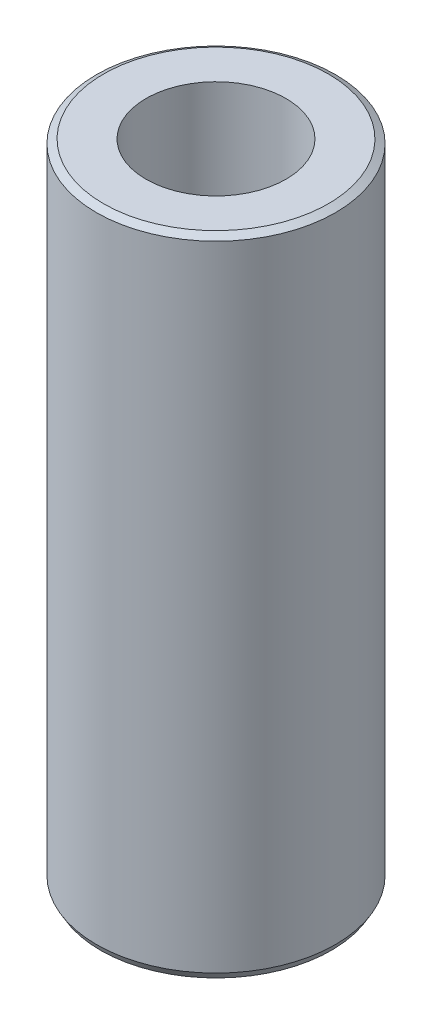
ISO-10303-21;
HEADER;
FILE_DESCRIPTION(('STEP AP214'),'2;1');
FILE_NAME('part.step','',(''),(''),'','','');
FILE_SCHEMA(('AUTOMOTIVE_DESIGN { 1 0 10303 214 1 1 1 1 }'));
ENDSEC;
DATA;
#1=APPLICATION_CONTEXT('core data for automotive mechanical design processes');
#2=APPLICATION_PROTOCOL_DEFINITION('international standard','automotive_design',2000,#1);
#3=PRODUCT_CONTEXT('',#1,'mechanical');
#4=PRODUCT('Part','Part','',(#3));
#5=PRODUCT_RELATED_PRODUCT_CATEGORY('part','',(#4));
#6=PRODUCT_DEFINITION_FORMATION('','',#4);
#7=PRODUCT_DEFINITION_CONTEXT('part definition',#1,'design');
#8=PRODUCT_DEFINITION('design','',#6,#7);
#9=PRODUCT_DEFINITION_SHAPE('','',#8);
#10=(LENGTH_UNIT() NAMED_UNIT(*) SI_UNIT(.MILLI.,.METRE.));
#11=(NAMED_UNIT(*) PLANE_ANGLE_UNIT() SI_UNIT($,.RADIAN.));
#12=(NAMED_UNIT(*) SI_UNIT($,.STERADIAN.) SOLID_ANGLE_UNIT());
#13=UNCERTAINTY_MEASURE_WITH_UNIT(LENGTH_MEASURE(1.E-05),#10,'distance_accuracy_value','');
#14=(GEOMETRIC_REPRESENTATION_CONTEXT(3) GLOBAL_UNCERTAINTY_ASSIGNED_CONTEXT((#13)) GLOBAL_UNIT_ASSIGNED_CONTEXT((#10,
#11,#12)) REPRESENTATION_CONTEXT('',''));
#15=CARTESIAN_POINT('',(0.,0.,0.));
#16=DIRECTION('',(0.,0.,1.));
#17=DIRECTION('',(1.,0.,0.));
#18=AXIS2_PLACEMENT_3D('',#15,#16,#17);
#19=CARTESIAN_POINT('',(0.,107.913975446686,0.));
#20=DIRECTION('',(0.,-1.,0.));
#21=DIRECTION('',(0.,0.,-1.));
#22=AXIS2_PLACEMENT_3D('',#19,#20,#21);
#23=CYLINDRICAL_SURFACE('',#22,20.);
#24=CARTESIAN_POINT('',(0.,107.224694065018,0.));
#25=DIRECTION('',(0.,1.,0.));
#26=DIRECTION('',(0.,0.,1.));
#27=AXIS2_PLACEMENT_3D('',#24,#25,#26);
#28=CIRCLE('',#27,20.);
#29=CARTESIAN_POINT('',(0.,107.224694065018,20.));
#30=VERTEX_POINT('',#29);
#31=EDGE_CURVE('E50',#30,#30,#28,.F.);
#32=ORIENTED_EDGE('',*,*,#31,.T.);
#33=EDGE_LOOP('',(#32));
#34=FACE_BOUND('',#33,.T.);
#35=CARTESIAN_POINT('',(0.,1.19387037376095,0.));
#36=DIRECTION('',(0.,1.,0.));
#37=DIRECTION('',(0.,0.,1.));
#38=AXIS2_PLACEMENT_3D('',#35,#36,#37);
#39=CIRCLE('',#38,20.);
#40=CARTESIAN_POINT('',(0.,1.19387037376095,20.));
#41=VERTEX_POINT('',#40);
#42=EDGE_CURVE('E51',#41,#41,#39,.T.);
#43=ORIENTED_EDGE('',*,*,#42,.T.);
#44=EDGE_LOOP('',(#43));
#45=FACE_BOUND('',#44,.T.);
#46=ADVANCED_FACE('F39',(#34,#45),#23,.T.);
#47=CARTESIAN_POINT('',(0.,107.913975446686,0.));
#48=DIRECTION('',(0.,1.,0.));
#49=DIRECTION('',(0.,0.,1.));
#50=AXIS2_PLACEMENT_3D('',#47,#48,#49);
#51=PLANE('',#50);
#52=CARTESIAN_POINT('',(0.,107.913975446686,0.));
#53=DIRECTION('',(0.,1.,0.));
#54=DIRECTION('',(0.,0.,1.));
#55=AXIS2_PLACEMENT_3D('',#52,#53,#54);
#56=CIRCLE('',#55,18.8061296262391);
#57=CARTESIAN_POINT('',(0.,107.913975446686,18.8061296262391));
#58=VERTEX_POINT('',#57);
#59=EDGE_CURVE('E54',#58,#58,#56,.T.);
#60=ORIENTED_EDGE('',*,*,#59,.T.);
#61=EDGE_LOOP('',(#60));
#62=FACE_BOUND('',#61,.T.);
#63=CARTESIAN_POINT('',(0.,107.913975446686,0.));
#64=DIRECTION('',(0.,1.,0.));
#65=DIRECTION('',(0.,0.,1.));
#66=AXIS2_PLACEMENT_3D('',#63,#64,#65);
#67=CIRCLE('',#66,11.7107339363376);
#68=CARTESIAN_POINT('',(0.,107.913975446686,11.7107339363376));
#69=VERTEX_POINT('',#68);
#70=EDGE_CURVE('E58',#69,#69,#67,.T.);
#71=ORIENTED_EDGE('',*,*,#70,.F.);
#72=EDGE_LOOP('',(#71));
#73=FACE_BOUND('',#72,.T.);
#74=ADVANCED_FACE('F69',(#62,#73),#51,.T.);
#75=CARTESIAN_POINT('',(0.,0.,0.));
#76=DIRECTION('',(0.,1.,0.));
#77=DIRECTION('',(0.,0.,1.));
#78=AXIS2_PLACEMENT_3D('',#75,#76,#77);
#79=PLANE('',#78);
#80=CARTESIAN_POINT('',(0.,0.,0.));
#81=DIRECTION('',(0.,1.,0.));
#82=DIRECTION('',(0.,0.,1.));
#83=AXIS2_PLACEMENT_3D('',#80,#81,#82);
#84=CIRCLE('',#83,19.3107186183316);
#85=CARTESIAN_POINT('',(0.,0.,19.3107186183316));
#86=VERTEX_POINT('',#85);
#87=EDGE_CURVE('E10',#86,#86,#84,.F.);
#88=ORIENTED_EDGE('',*,*,#87,.T.);
#89=EDGE_LOOP('',(#88));
#90=FACE_BOUND('',#89,.T.);
#91=CARTESIAN_POINT('',(0.,0.,0.));
#92=DIRECTION('',(0.,1.,0.));
#93=DIRECTION('',(0.,0.,1.));
#94=AXIS2_PLACEMENT_3D('',#91,#92,#93);
#95=CIRCLE('',#94,11.7107339363376);
#96=CARTESIAN_POINT('',(0.,0.,11.7107339363376));
#97=VERTEX_POINT('',#96);
#98=EDGE_CURVE('E63',#97,#97,#95,.T.);
#99=ORIENTED_EDGE('',*,*,#98,.T.);
#100=EDGE_LOOP('',(#99));
#101=FACE_BOUND('',#100,.T.);
#102=ADVANCED_FACE('F75',(#90,#101),#79,.F.);
#103=CARTESIAN_POINT('',(0.,107.913975446686,0.));
#104=DIRECTION('',(0.,-1.,0.));
#105=DIRECTION('',(0.,0.,-1.));
#106=AXIS2_PLACEMENT_3D('',#103,#104,#105);
#107=CYLINDRICAL_SURFACE('',#106,11.7107339363376);
#108=ORIENTED_EDGE('',*,*,#70,.T.);
#109=EDGE_LOOP('',(#108));
#110=FACE_BOUND('',#109,.T.);
#111=ORIENTED_EDGE('',*,*,#98,.F.);
#112=EDGE_LOOP('',(#111));
#113=FACE_BOUND('',#112,.T.);
#114=ADVANCED_FACE('F70',(#110,#113),#107,.F.);
#115=CARTESIAN_POINT('',(0.,107.913975446686,0.));
#116=DIRECTION('',(0.,-1.,0.));
#117=DIRECTION('',(0.,0.,-1.));
#118=AXIS2_PLACEMENT_3D('',#115,#116,#117);
#119=CONICAL_SURFACE('',#118,18.8061296262391,1.0471975511966);
#120=ORIENTED_EDGE('',*,*,#31,.F.);
#121=EDGE_LOOP('',(#120));
#122=FACE_BOUND('',#121,.T.);
#123=ORIENTED_EDGE('',*,*,#59,.F.);
#124=EDGE_LOOP('',(#123));
#125=FACE_BOUND('',#124,.T.);
#126=ADVANCED_FACE('F81',(#122,#125),#119,.T.);
#127=CARTESIAN_POINT('',(0.,1.19387037376095,0.));
#128=DIRECTION('',(0.,1.,0.));
#129=DIRECTION('',(0.,0.,1.));
#130=AXIS2_PLACEMENT_3D('',#127,#128,#129);
#131=CONICAL_SURFACE('',#130,20.,0.523598775598297);
#132=ORIENTED_EDGE('',*,*,#87,.F.);
#133=EDGE_LOOP('',(#132));
#134=FACE_BOUND('',#133,.T.);
#135=ORIENTED_EDGE('',*,*,#42,.F.);
#136=EDGE_LOOP('',(#135));
#137=FACE_BOUND('',#136,.T.);
#138=ADVANCED_FACE('F45',(#134,#137),#131,.T.);
#139=CLOSED_SHELL('',(#46,#74,#102,#114,#126,#138));
#140=MANIFOLD_SOLID_BREP('B2',#139);
#141=ADVANCED_BREP_SHAPE_REPRESENTATION('',(#18,#140),#14);
#142=SHAPE_DEFINITION_REPRESENTATION(#9,#141);
ENDSEC;
END-ISO-10303-21;
